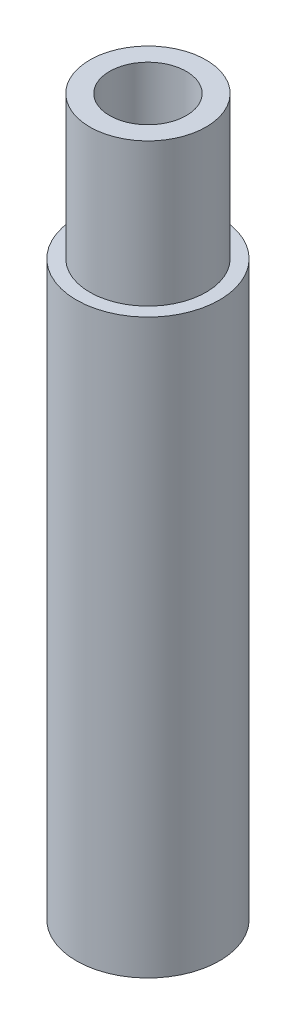
ISO-10303-21;
HEADER;
FILE_DESCRIPTION(('STEP AP214'),'2;1');
FILE_NAME('part.step','',(''),(''),'','','');
FILE_SCHEMA(('AUTOMOTIVE_DESIGN { 1 0 10303 214 1 1 1 1 }'));
ENDSEC;
DATA;
#1=APPLICATION_CONTEXT('core data for automotive mechanical design processes');
#2=APPLICATION_PROTOCOL_DEFINITION('international standard','automotive_design',2000,#1);
#3=PRODUCT_CONTEXT('',#1,'mechanical');
#4=PRODUCT('Part','Part','',(#3));
#5=PRODUCT_RELATED_PRODUCT_CATEGORY('part','',(#4));
#6=PRODUCT_DEFINITION_FORMATION('','',#4);
#7=PRODUCT_DEFINITION_CONTEXT('part definition',#1,'design');
#8=PRODUCT_DEFINITION('design','',#6,#7);
#9=PRODUCT_DEFINITION_SHAPE('','',#8);
#10=(LENGTH_UNIT() NAMED_UNIT(*) SI_UNIT(.MILLI.,.METRE.));
#11=(NAMED_UNIT(*) PLANE_ANGLE_UNIT() SI_UNIT($,.RADIAN.));
#12=(NAMED_UNIT(*) SI_UNIT($,.STERADIAN.) SOLID_ANGLE_UNIT());
#13=UNCERTAINTY_MEASURE_WITH_UNIT(LENGTH_MEASURE(1.E-05),#10,'distance_accuracy_value','');
#14=(GEOMETRIC_REPRESENTATION_CONTEXT(3) GLOBAL_UNCERTAINTY_ASSIGNED_CONTEXT((#13)) GLOBAL_UNIT_ASSIGNED_CONTEXT((#10,
#11,#12)) REPRESENTATION_CONTEXT('',''));
#15=CARTESIAN_POINT('',(0.,0.,0.));
#16=DIRECTION('',(0.,0.,1.));
#17=DIRECTION('',(1.,0.,0.));
#18=AXIS2_PLACEMENT_3D('',#15,#16,#17);
#19=CARTESIAN_POINT('',(0.,31.75,0.));
#20=DIRECTION('',(0.,1.,0.));
#21=DIRECTION('',(0.,0.,1.));
#22=AXIS2_PLACEMENT_3D('',#19,#20,#21);
#23=PLANE('',#22);
#24=CARTESIAN_POINT('',(0.,31.75,0.));
#25=DIRECTION('',(0.,1.,0.));
#26=DIRECTION('',(0.,0.,1.));
#27=AXIS2_PLACEMENT_3D('',#24,#25,#26);
#28=CIRCLE('',#27,1.7018);
#29=CARTESIAN_POINT('',(0.,31.75,1.7018));
#30=VERTEX_POINT('',#29);
#31=EDGE_CURVE('E365',#30,#30,#28,.T.);
#32=ORIENTED_EDGE('',*,*,#31,.F.);
#33=EDGE_LOOP('',(#32));
#34=FACE_BOUND('',#33,.T.);
#35=CARTESIAN_POINT('',(0.,31.75,0.));
#36=DIRECTION('',(0.,1.,0.));
#37=DIRECTION('',(0.,0.,1.));
#38=AXIS2_PLACEMENT_3D('',#35,#36,#37);
#39=CIRCLE('',#38,2.5796875);
#40=CARTESIAN_POINT('',(0.,31.75,2.5796875));
#41=VERTEX_POINT('',#40);
#42=EDGE_CURVE('E381',#41,#41,#39,.T.);
#43=ORIENTED_EDGE('',*,*,#42,.T.);
#44=EDGE_LOOP('',(#43));
#45=FACE_BOUND('',#44,.T.);
#46=ADVANCED_FACE('F358',(#34,#45),#23,.T.);
#47=CARTESIAN_POINT('',(0.,31.75,0.));
#48=DIRECTION('',(0.,-1.,0.));
#49=DIRECTION('',(0.,0.,-1.));
#50=AXIS2_PLACEMENT_3D('',#47,#48,#49);
#51=CYLINDRICAL_SURFACE('',#50,3.175);
#52=CARTESIAN_POINT('',(0.,0.,0.));
#53=DIRECTION('',(0.,1.,0.));
#54=DIRECTION('',(0.,0.,1.));
#55=AXIS2_PLACEMENT_3D('',#52,#53,#54);
#56=CIRCLE('',#55,3.175);
#57=CARTESIAN_POINT('',(0.,0.,3.175));
#58=VERTEX_POINT('',#57);
#59=EDGE_CURVE('E10',#58,#58,#56,.T.);
#60=ORIENTED_EDGE('',*,*,#59,.T.);
#61=EDGE_LOOP('',(#60));
#62=FACE_BOUND('',#61,.T.);
#63=CARTESIAN_POINT('',(0.,25.4,0.));
#64=DIRECTION('',(0.,1.,0.));
#65=DIRECTION('',(0.,0.,1.));
#66=AXIS2_PLACEMENT_3D('',#63,#64,#65);
#67=CIRCLE('',#66,3.175);
#68=CARTESIAN_POINT('',(0.,25.4,3.175));
#69=VERTEX_POINT('',#68);
#70=EDGE_CURVE('E373',#69,#69,#67,.T.);
#71=ORIENTED_EDGE('',*,*,#70,.F.);
#72=EDGE_LOOP('',(#71));
#73=FACE_BOUND('',#72,.T.);
#74=ADVANCED_FACE('F360',(#62,#73),#51,.T.);
#75=CARTESIAN_POINT('',(0.,0.,0.));
#76=DIRECTION('',(0.,1.,0.));
#77=DIRECTION('',(0.,0.,1.));
#78=AXIS2_PLACEMENT_3D('',#75,#76,#77);
#79=PLANE('',#78);
#80=ORIENTED_EDGE('',*,*,#59,.F.);
#81=EDGE_LOOP('',(#80));
#82=FACE_BOUND('',#81,.T.);
#83=CARTESIAN_POINT('',(0.,0.,0.));
#84=DIRECTION('',(0.,1.,0.));
#85=DIRECTION('',(0.,0.,1.));
#86=AXIS2_PLACEMENT_3D('',#83,#84,#85);
#87=CIRCLE('',#86,1.7018);
#88=CARTESIAN_POINT('',(0.,0.,1.7018));
#89=VERTEX_POINT('',#88);
#90=EDGE_CURVE('E369',#89,#89,#87,.T.);
#91=ORIENTED_EDGE('',*,*,#90,.T.);
#92=EDGE_LOOP('',(#91));
#93=FACE_BOUND('',#92,.T.);
#94=ADVANCED_FACE('F403',(#82,#93),#79,.F.);
#95=CARTESIAN_POINT('',(0.,31.75,0.));
#96=DIRECTION('',(0.,-1.,0.));
#97=DIRECTION('',(0.,0.,-1.));
#98=AXIS2_PLACEMENT_3D('',#95,#96,#97);
#99=CYLINDRICAL_SURFACE('',#98,1.7018);
#100=ORIENTED_EDGE('',*,*,#31,.T.);
#101=EDGE_LOOP('',(#100));
#102=FACE_BOUND('',#101,.T.);
#103=ORIENTED_EDGE('',*,*,#90,.F.);
#104=EDGE_LOOP('',(#103));
#105=FACE_BOUND('',#104,.T.);
#106=ADVANCED_FACE('F394',(#102,#105),#99,.F.);
#107=CARTESIAN_POINT('',(0.,25.4,0.));
#108=DIRECTION('',(0.,1.,0.));
#109=DIRECTION('',(0.,0.,1.));
#110=AXIS2_PLACEMENT_3D('',#107,#108,#109);
#111=PLANE('',#110);
#112=CARTESIAN_POINT('',(0.,25.4,0.));
#113=DIRECTION('',(0.,1.,0.));
#114=DIRECTION('',(0.,0.,1.));
#115=AXIS2_PLACEMENT_3D('',#112,#113,#114);
#116=CIRCLE('',#115,2.5796875);
#117=CARTESIAN_POINT('',(0.,25.4,2.5796875));
#118=VERTEX_POINT('',#117);
#119=EDGE_CURVE('E378',#118,#118,#116,.T.);
#120=ORIENTED_EDGE('',*,*,#119,.F.);
#121=EDGE_LOOP('',(#120));
#122=FACE_BOUND('',#121,.T.);
#123=ORIENTED_EDGE('',*,*,#70,.T.);
#124=EDGE_LOOP('',(#123));
#125=FACE_BOUND('',#124,.T.);
#126=ADVANCED_FACE('F388',(#122,#125),#111,.T.);
#127=CARTESIAN_POINT('',(0.,25.4,0.));
#128=DIRECTION('',(0.,1.,0.));
#129=DIRECTION('',(0.,0.,1.));
#130=AXIS2_PLACEMENT_3D('',#127,#128,#129);
#131=CYLINDRICAL_SURFACE('',#130,2.5796875);
#132=ORIENTED_EDGE('',*,*,#119,.T.);
#133=EDGE_LOOP('',(#132));
#134=FACE_BOUND('',#133,.T.);
#135=ORIENTED_EDGE('',*,*,#42,.F.);
#136=EDGE_LOOP('',(#135));
#137=FACE_BOUND('',#136,.T.);
#138=ADVANCED_FACE('F386',(#134,#137),#131,.T.);
#139=CLOSED_SHELL('',(#46,#74,#94,#106,#126,#138));
#140=MANIFOLD_SOLID_BREP('B2',#139);
#141=ADVANCED_BREP_SHAPE_REPRESENTATION('',(#18,#140),#14);
#142=SHAPE_DEFINITION_REPRESENTATION(#9,#141);
ENDSEC;
END-ISO-10303-21;
